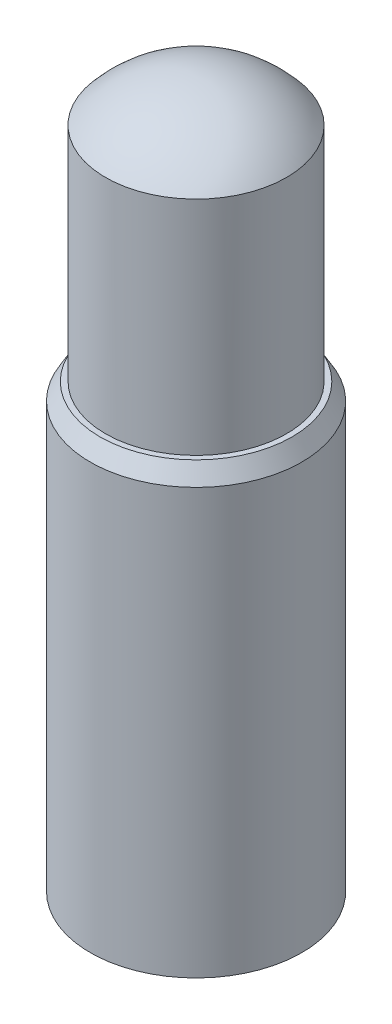
ISO-10303-21;
HEADER;
FILE_DESCRIPTION(('STEP AP214'),'2;1');
FILE_NAME('part.step','',(''),(''),'','','');
FILE_SCHEMA(('AUTOMOTIVE_DESIGN { 1 0 10303 214 1 1 1 1 }'));
ENDSEC;
DATA;
#1=APPLICATION_CONTEXT('core data for automotive mechanical design processes');
#2=APPLICATION_PROTOCOL_DEFINITION('international standard','automotive_design',2000,#1);
#3=PRODUCT_CONTEXT('',#1,'mechanical');
#4=PRODUCT('Part','Part','',(#3));
#5=PRODUCT_RELATED_PRODUCT_CATEGORY('part','',(#4));
#6=PRODUCT_DEFINITION_FORMATION('','',#4);
#7=PRODUCT_DEFINITION_CONTEXT('part definition',#1,'design');
#8=PRODUCT_DEFINITION('design','',#6,#7);
#9=PRODUCT_DEFINITION_SHAPE('','',#8);
#10=(LENGTH_UNIT() NAMED_UNIT(*) SI_UNIT(.MILLI.,.METRE.));
#11=(NAMED_UNIT(*) PLANE_ANGLE_UNIT() SI_UNIT($,.RADIAN.));
#12=(NAMED_UNIT(*) SI_UNIT($,.STERADIAN.) SOLID_ANGLE_UNIT());
#13=UNCERTAINTY_MEASURE_WITH_UNIT(LENGTH_MEASURE(1.E-05),#10,'distance_accuracy_value','');
#14=(GEOMETRIC_REPRESENTATION_CONTEXT(3) GLOBAL_UNCERTAINTY_ASSIGNED_CONTEXT((#13)) GLOBAL_UNIT_ASSIGNED_CONTEXT((#10,
#11,#12)) REPRESENTATION_CONTEXT('',''));
#15=CARTESIAN_POINT('',(0.,0.,0.));
#16=DIRECTION('',(0.,0.,1.));
#17=DIRECTION('',(1.,0.,0.));
#18=AXIS2_PLACEMENT_3D('',#15,#16,#17);
#19=CARTESIAN_POINT('',(6.885,4.04,0.));
#20=DIRECTION('',(0.,-1.,0.));
#21=DIRECTION('',(0.,0.,-1.));
#22=AXIS2_PLACEMENT_3D('',#19,#20,#21);
#23=PLANE('',#22);
#24=CARTESIAN_POINT('',(6.35,4.04,0.));
#25=DIRECTION('',(0.,-1.,0.));
#26=DIRECTION('',(0.,0.,-1.));
#27=AXIS2_PLACEMENT_3D('',#24,#25,#26);
#28=CIRCLE('',#27,0.567264973081037);
#29=CARTESIAN_POINT('',(6.35,4.04,-0.567264973081037));
#30=VERTEX_POINT('',#29);
#31=EDGE_CURVE('E41',#30,#30,#28,.T.);
#32=ORIENTED_EDGE('',*,*,#31,.F.);
#33=EDGE_LOOP('',(#32));
#34=FACE_BOUND('',#33,.T.);
#35=CARTESIAN_POINT('',(6.35,4.04,0.));
#36=DIRECTION('',(0.,-1.,0.));
#37=DIRECTION('',(0.,0.,-1.));
#38=AXIS2_PLACEMENT_3D('',#35,#36,#37);
#39=CIRCLE('',#38,0.535);
#40=CARTESIAN_POINT('',(6.35,4.04,-0.535));
#41=VERTEX_POINT('',#40);
#42=EDGE_CURVE('E10',#41,#41,#39,.T.);
#43=ORIENTED_EDGE('',*,*,#42,.T.);
#44=EDGE_LOOP('',(#43));
#45=FACE_BOUND('',#44,.T.);
#46=ADVANCED_FACE('F14',(#34,#45),#23,.F.);
#47=CARTESIAN_POINT('',(6.35,5.6,0.));
#48=DIRECTION('',(0.,-1.,0.));
#49=DIRECTION('',(0.,0.,-1.));
#50=AXIS2_PLACEMENT_3D('',#47,#48,#49);
#51=CYLINDRICAL_SURFACE('',#50,0.535);
#52=ORIENTED_EDGE('',*,*,#42,.F.);
#53=EDGE_LOOP('',(#52));
#54=FACE_BOUND('',#53,.T.);
#55=CARTESIAN_POINT('',(6.35,5.35141444372107,0.));
#56=DIRECTION('',(0.,-1.,0.));
#57=DIRECTION('',(0.,0.,-1.));
#58=AXIS2_PLACEMENT_3D('',#55,#56,#57);
#59=CIRCLE('',#58,0.535);
#60=CARTESIAN_POINT('',(6.35,5.35141444372107,-0.535));
#61=VERTEX_POINT('',#60);
#62=EDGE_CURVE('E21',#61,#61,#59,.T.);
#63=ORIENTED_EDGE('',*,*,#62,.T.);
#64=EDGE_LOOP('',(#63));
#65=FACE_BOUND('',#64,.T.);
#66=ADVANCED_FACE('F50',(#54,#65),#51,.T.);
#67=CARTESIAN_POINT('',(6.35,4.9,0.));
#68=DIRECTION('',(0.,-1.,0.));
#69=DIRECTION('',(1.,0.,0.));
#70=AXIS2_PLACEMENT_3D('',#67,#68,#69);
#71=SPHERICAL_SURFACE('',#70,0.7);
#72=ORIENTED_EDGE('',*,*,#62,.F.);
#73=EDGE_LOOP('',(#72));
#74=FACE_BOUND('',#73,.T.);
#75=ADVANCED_FACE('F55',(#74),#71,.T.);
#76=CARTESIAN_POINT('',(6.975,1.43,0.));
#77=DIRECTION('',(0.,1.,0.));
#78=DIRECTION('',(0.,0.,1.));
#79=AXIS2_PLACEMENT_3D('',#76,#77,#78);
#80=PLANE('',#79);
#81=CARTESIAN_POINT('',(6.35,1.43,0.));
#82=DIRECTION('',(0.,-1.,0.));
#83=DIRECTION('',(0.,0.,-1.));
#84=AXIS2_PLACEMENT_3D('',#81,#82,#83);
#85=CIRCLE('',#84,0.625);
#86=CARTESIAN_POINT('',(6.35,1.43,-0.625));
#87=VERTEX_POINT('',#86);
#88=EDGE_CURVE('E29',#87,#87,#85,.T.);
#89=ORIENTED_EDGE('',*,*,#88,.T.);
#90=EDGE_LOOP('',(#89));
#91=FACE_BOUND('',#90,.T.);
#92=ADVANCED_FACE('F60',(#91),#80,.F.);
#93=CARTESIAN_POINT('',(6.35,5.6,0.));
#94=DIRECTION('',(0.,-1.,0.));
#95=DIRECTION('',(0.,0.,-1.));
#96=AXIS2_PLACEMENT_3D('',#93,#94,#95);
#97=CYLINDRICAL_SURFACE('',#96,0.625);
#98=ORIENTED_EDGE('',*,*,#88,.F.);
#99=EDGE_LOOP('',(#98));
#100=FACE_BOUND('',#99,.T.);
#101=CARTESIAN_POINT('',(6.35,3.94,0.));
#102=DIRECTION('',(0.,-1.,0.));
#103=DIRECTION('',(0.,0.,-1.));
#104=AXIS2_PLACEMENT_3D('',#101,#102,#103);
#105=CIRCLE('',#104,0.625);
#106=CARTESIAN_POINT('',(6.35,3.94,-0.625));
#107=VERTEX_POINT('',#106);
#108=EDGE_CURVE('E35',#107,#107,#105,.T.);
#109=ORIENTED_EDGE('',*,*,#108,.T.);
#110=EDGE_LOOP('',(#109));
#111=FACE_BOUND('',#110,.T.);
#112=ADVANCED_FACE('F66',(#100,#111),#97,.T.);
#113=CARTESIAN_POINT('',(6.35,4.04,0.));
#114=DIRECTION('',(0.,-1.,0.));
#115=DIRECTION('',(0.,0.,-1.));
#116=AXIS2_PLACEMENT_3D('',#113,#114,#115);
#117=CONICAL_SURFACE('',#116,0.567264973081037,0.523598775598299);
#118=ORIENTED_EDGE('',*,*,#108,.F.);
#119=EDGE_LOOP('',(#118));
#120=FACE_BOUND('',#119,.T.);
#121=ORIENTED_EDGE('',*,*,#31,.T.);
#122=EDGE_LOOP('',(#121));
#123=FACE_BOUND('',#122,.T.);
#124=ADVANCED_FACE('F47',(#120,#123),#117,.T.);
#125=CLOSED_SHELL('',(#46,#66,#75,#92,#112,#124));
#126=MANIFOLD_SOLID_BREP('B1',#125);
#127=ADVANCED_BREP_SHAPE_REPRESENTATION('',(#18,#126),#14);
#128=SHAPE_DEFINITION_REPRESENTATION(#9,#127);
ENDSEC;
END-ISO-10303-21;
